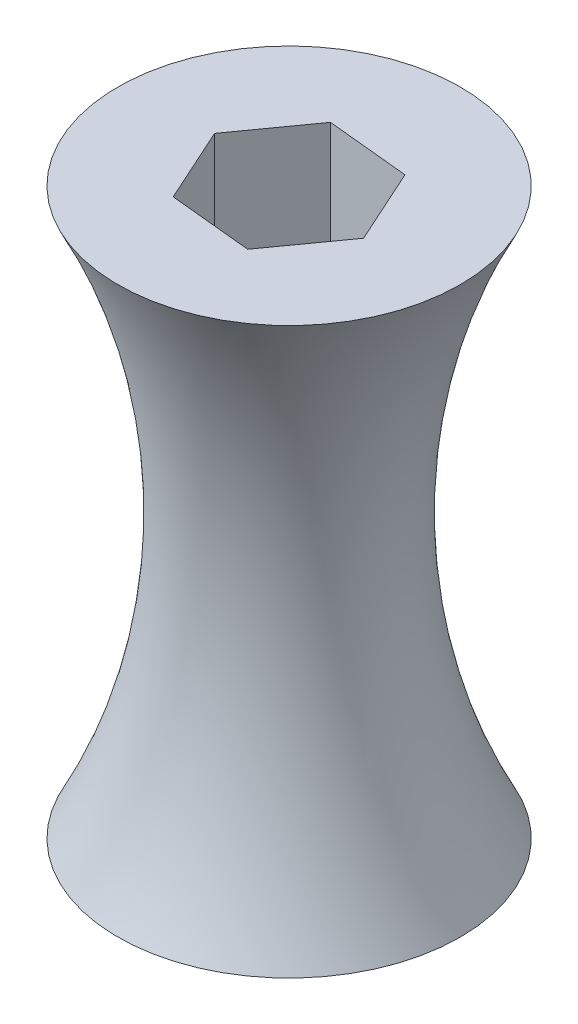
ISO-10303-21;
HEADER;
FILE_DESCRIPTION(('STEP AP214'),'2;1');
FILE_NAME('part.step','',(''),(''),'','','');
FILE_SCHEMA(('AUTOMOTIVE_DESIGN { 1 0 10303 214 1 1 1 1 }'));
ENDSEC;
DATA;
#1=APPLICATION_CONTEXT('core data for automotive mechanical design processes');
#2=APPLICATION_PROTOCOL_DEFINITION('international standard','automotive_design',2000,#1);
#3=PRODUCT_CONTEXT('',#1,'mechanical');
#4=PRODUCT('Part','Part','',(#3));
#5=PRODUCT_RELATED_PRODUCT_CATEGORY('part','',(#4));
#6=PRODUCT_DEFINITION_FORMATION('','',#4);
#7=PRODUCT_DEFINITION_CONTEXT('part definition',#1,'design');
#8=PRODUCT_DEFINITION('design','',#6,#7);
#9=PRODUCT_DEFINITION_SHAPE('','',#8);
#10=(LENGTH_UNIT() NAMED_UNIT(*) SI_UNIT(.MILLI.,.METRE.));
#11=(NAMED_UNIT(*) PLANE_ANGLE_UNIT() SI_UNIT($,.RADIAN.));
#12=(NAMED_UNIT(*) SI_UNIT($,.STERADIAN.) SOLID_ANGLE_UNIT());
#13=UNCERTAINTY_MEASURE_WITH_UNIT(LENGTH_MEASURE(1.E-05),#10,'distance_accuracy_value','');
#14=(GEOMETRIC_REPRESENTATION_CONTEXT(3) GLOBAL_UNCERTAINTY_ASSIGNED_CONTEXT((#13)) GLOBAL_UNIT_ASSIGNED_CONTEXT((#10,
#11,#12)) REPRESENTATION_CONTEXT('',''));
#15=CARTESIAN_POINT('',(0.,0.,0.));
#16=DIRECTION('',(0.,0.,1.));
#17=DIRECTION('',(1.,0.,0.));
#18=AXIS2_PLACEMENT_3D('',#15,#16,#17);
#19=CARTESIAN_POINT('',(0.,104.775,0.));
#20=DIRECTION('',(0.,1.,0.));
#21=DIRECTION('',(0.,0.,1.));
#22=AXIS2_PLACEMENT_3D('',#19,#20,#21);
#23=PLANE('',#22);
#24=DIRECTION('',(0.582558314438273,0.,-0.812788908806486));
#25=VECTOR('',#24,1.);
#26=CARTESIAN_POINT('',(-15.3236366613952,104.775,-1.510781079292));
#27=LINE('',#26,#25);
#28=CARTESIAN_POINT('',(-15.3236366613952,104.775,-1.510781079292));
#29=VERTEX_POINT('',#28);
#30=CARTESIAN_POINT('',(-6.35344353647385,104.775,-14.0260491667768));
#31=VERTEX_POINT('',#30);
#32=EDGE_CURVE('E106',#29,#31,#27,.T.);
#33=ORIENTED_EDGE('',*,*,#32,.T.);
#34=DIRECTION('',(0.995175000159787,0.,0.0981158450861447));
#35=VECTOR('',#34,1.);
#36=CARTESIAN_POINT('',(-6.35344353647385,104.775,-14.0260491667768));
#37=LINE('',#36,#35);
#38=CARTESIAN_POINT('',(8.97019312492135,104.775,-12.5152680874848));
#39=VERTEX_POINT('',#38);
#40=EDGE_CURVE('E92',#31,#39,#37,.T.);
#41=ORIENTED_EDGE('',*,*,#40,.T.);
#42=DIRECTION('',(0.412616685721513,0.,0.910904753892631));
#43=VECTOR('',#42,1.);
#44=CARTESIAN_POINT('',(8.97019312492135,104.775,-12.5152680874848));
#45=LINE('',#44,#43);
#46=CARTESIAN_POINT('',(15.3236366613952,104.775,1.510781079292));
#47=VERTEX_POINT('',#46);
#48=EDGE_CURVE('E135',#39,#47,#45,.T.);
#49=ORIENTED_EDGE('',*,*,#48,.T.);
#50=DIRECTION('',(-0.582558314438273,0.,0.812788908806486));
#51=VECTOR('',#50,1.);
#52=CARTESIAN_POINT('',(15.3236366613952,104.775,1.510781079292));
#53=LINE('',#52,#51);
#54=CARTESIAN_POINT('',(6.35344353647386,104.775,14.0260491667768));
#55=VERTEX_POINT('',#54);
#56=EDGE_CURVE('E130',#47,#55,#53,.T.);
#57=ORIENTED_EDGE('',*,*,#56,.T.);
#58=DIRECTION('',(-0.995175000159787,0.,-0.0981158450861446));
#59=VECTOR('',#58,1.);
#60=CARTESIAN_POINT('',(6.35344353647386,104.775,14.0260491667768));
#61=LINE('',#60,#59);
#62=CARTESIAN_POINT('',(-8.97019312492135,104.775,12.5152680874848));
#63=VERTEX_POINT('',#62);
#64=EDGE_CURVE('E126',#55,#63,#61,.T.);
#65=ORIENTED_EDGE('',*,*,#64,.T.);
#66=DIRECTION('',(-0.412616685721514,0.,-0.91090475389263));
#67=VECTOR('',#66,1.);
#68=CARTESIAN_POINT('',(-8.97019312492135,104.775,12.5152680874848));
#69=LINE('',#68,#67);
#70=EDGE_CURVE('E48',#63,#29,#69,.T.);
#71=ORIENTED_EDGE('',*,*,#70,.T.);
#72=EDGE_LOOP('',(#33,#41,#49,#57,#65,#71));
#73=FACE_BOUND('',#72,.T.);
#74=CARTESIAN_POINT('',(0.,104.775,0.));
#75=DIRECTION('',(0.,-1.,0.));
#76=DIRECTION('',(1.,0.,0.));
#77=AXIS2_PLACEMENT_3D('',#74,#75,#76);
#78=CIRCLE('',#77,31.75);
#79=CARTESIAN_POINT('',(31.75,104.775,0.));
#80=VERTEX_POINT('',#79);
#81=EDGE_CURVE('E164',#80,#80,#78,.T.);
#82=ORIENTED_EDGE('',*,*,#81,.F.);
#83=EDGE_LOOP('',(#82));
#84=FACE_BOUND('',#83,.T.);
#85=ADVANCED_FACE('F39',(#73,#84),#23,.T.);
#86=CARTESIAN_POINT('',(0.,0.,0.));
#87=DIRECTION('',(0.,1.,0.));
#88=DIRECTION('',(0.,0.,1.));
#89=AXIS2_PLACEMENT_3D('',#86,#87,#88);
#90=PLANE('',#89);
#91=DIRECTION('',(0.995175000159787,0.,0.0981158450861447));
#92=VECTOR('',#91,1.);
#93=CARTESIAN_POINT('',(-6.35344353647385,0.,-14.0260491667768));
#94=LINE('',#93,#92);
#95=CARTESIAN_POINT('',(-6.35344353647385,0.,-14.0260491667768));
#96=VERTEX_POINT('',#95);
#97=CARTESIAN_POINT('',(8.97019312492135,0.,-12.5152680874848));
#98=VERTEX_POINT('',#97);
#99=EDGE_CURVE('E152',#96,#98,#94,.T.);
#100=ORIENTED_EDGE('',*,*,#99,.F.);
#101=DIRECTION('',(0.582558314438273,0.,-0.812788908806486));
#102=VECTOR('',#101,1.);
#103=CARTESIAN_POINT('',(-15.3236366613952,0.,-1.510781079292));
#104=LINE('',#103,#102);
#105=CARTESIAN_POINT('',(-15.3236366613952,0.,-1.510781079292));
#106=VERTEX_POINT('',#105);
#107=EDGE_CURVE('E109',#106,#96,#104,.T.);
#108=ORIENTED_EDGE('',*,*,#107,.F.);
#109=DIRECTION('',(-0.412616685721513,0.,-0.91090475389263));
#110=VECTOR('',#109,1.);
#111=CARTESIAN_POINT('',(-8.97019312492135,0.,12.5152680874848));
#112=LINE('',#111,#110);
#113=CARTESIAN_POINT('',(-8.97019312492135,0.,12.5152680874848));
#114=VERTEX_POINT('',#113);
#115=EDGE_CURVE('E121',#114,#106,#112,.T.);
#116=ORIENTED_EDGE('',*,*,#115,.F.);
#117=DIRECTION('',(-0.995175000159787,0.,-0.0981158450861446));
#118=VECTOR('',#117,1.);
#119=CARTESIAN_POINT('',(6.35344353647386,0.,14.0260491667768));
#120=LINE('',#119,#118);
#121=CARTESIAN_POINT('',(6.35344353647386,0.,14.0260491667768));
#122=VERTEX_POINT('',#121);
#123=EDGE_CURVE('E61',#122,#114,#120,.T.);
#124=ORIENTED_EDGE('',*,*,#123,.F.);
#125=DIRECTION('',(-0.582558314438273,0.,0.812788908806486));
#126=VECTOR('',#125,1.);
#127=CARTESIAN_POINT('',(15.3236366613952,0.,1.510781079292));
#128=LINE('',#127,#126);
#129=CARTESIAN_POINT('',(15.3236366613952,0.,1.510781079292));
#130=VERTEX_POINT('',#129);
#131=EDGE_CURVE('E117',#130,#122,#128,.T.);
#132=ORIENTED_EDGE('',*,*,#131,.F.);
#133=DIRECTION('',(0.412616685721513,0.,0.91090475389263));
#134=VECTOR('',#133,1.);
#135=CARTESIAN_POINT('',(8.97019312492135,0.,-12.5152680874848));
#136=LINE('',#135,#134);
#137=EDGE_CURVE('E150',#98,#130,#136,.T.);
#138=ORIENTED_EDGE('',*,*,#137,.F.);
#139=EDGE_LOOP('',(#100,#108,#116,#124,#132,#138));
#140=FACE_BOUND('',#139,.T.);
#141=CARTESIAN_POINT('',(0.,0.,0.));
#142=DIRECTION('',(0.,-1.,0.));
#143=DIRECTION('',(1.,0.,0.));
#144=AXIS2_PLACEMENT_3D('',#141,#142,#143);
#145=CIRCLE('',#144,31.75);
#146=CARTESIAN_POINT('',(31.75,0.,0.));
#147=VERTEX_POINT('',#146);
#148=EDGE_CURVE('E168',#147,#147,#145,.T.);
#149=ORIENTED_EDGE('',*,*,#148,.T.);
#150=EDGE_LOOP('',(#149));
#151=FACE_BOUND('',#150,.T.);
#152=ADVANCED_FACE('F41',(#140,#151),#90,.F.);
#153=CARTESIAN_POINT('',(-15.3236366613952,146.322269260893,-1.510781079292));
#154=DIRECTION('',(-0.812788908806486,0.,-0.582558314438273));
#155=DIRECTION('',(-0.582558314438273,0.,0.812788908806486));
#156=AXIS2_PLACEMENT_3D('',#153,#154,#155);
#157=PLANE('',#156);
#158=DIRECTION('',(0.,-1.,0.));
#159=VECTOR('',#158,1.);
#160=CARTESIAN_POINT('',(-15.3236366613952,146.322269260893,-1.510781079292));
#161=LINE('',#160,#159);
#162=EDGE_CURVE('E11',#29,#106,#161,.T.);
#163=ORIENTED_EDGE('',*,*,#162,.T.);
#164=ORIENTED_EDGE('',*,*,#107,.T.);
#165=DIRECTION('',(0.,-1.,0.));
#166=VECTOR('',#165,1.);
#167=CARTESIAN_POINT('',(-6.35344353647385,146.322269260893,-14.0260491667768));
#168=LINE('',#167,#166);
#169=EDGE_CURVE('E96',#31,#96,#168,.T.);
#170=ORIENTED_EDGE('',*,*,#169,.F.);
#171=ORIENTED_EDGE('',*,*,#32,.F.);
#172=EDGE_LOOP('',(#163,#164,#170,#171));
#173=FACE_BOUND('',#172,.T.);
#174=ADVANCED_FACE('F105',(#173),#157,.F.);
#175=CARTESIAN_POINT('',(-6.35344353647385,146.322269260893,-14.0260491667768));
#176=DIRECTION('',(0.0981158450861447,0.,-0.995175000159787));
#177=DIRECTION('',(-0.995175000159787,0.,-0.0981158450861447));
#178=AXIS2_PLACEMENT_3D('',#175,#176,#177);
#179=PLANE('',#178);
#180=ORIENTED_EDGE('',*,*,#169,.T.);
#181=ORIENTED_EDGE('',*,*,#99,.T.);
#182=DIRECTION('',(0.,-1.,0.));
#183=VECTOR('',#182,1.);
#184=CARTESIAN_POINT('',(8.97019312492135,146.322269260893,-12.5152680874848));
#185=LINE('',#184,#183);
#186=EDGE_CURVE('E98',#39,#98,#185,.T.);
#187=ORIENTED_EDGE('',*,*,#186,.F.);
#188=ORIENTED_EDGE('',*,*,#40,.F.);
#189=EDGE_LOOP('',(#180,#181,#187,#188));
#190=FACE_BOUND('',#189,.T.);
#191=ADVANCED_FACE('F94',(#190),#179,.F.);
#192=CARTESIAN_POINT('',(8.97019312492135,146.322269260893,-12.5152680874848));
#193=DIRECTION('',(0.910904753892631,0.,-0.412616685721513));
#194=DIRECTION('',(-0.412616685721513,0.,-0.910904753892631));
#195=AXIS2_PLACEMENT_3D('',#192,#193,#194);
#196=PLANE('',#195);
#197=ORIENTED_EDGE('',*,*,#186,.T.);
#198=ORIENTED_EDGE('',*,*,#137,.T.);
#199=DIRECTION('',(0.,-1.,0.));
#200=VECTOR('',#199,1.);
#201=CARTESIAN_POINT('',(15.3236366613952,146.322269260893,1.510781079292));
#202=LINE('',#201,#200);
#203=EDGE_CURVE('E134',#47,#130,#202,.T.);
#204=ORIENTED_EDGE('',*,*,#203,.F.);
#205=ORIENTED_EDGE('',*,*,#48,.F.);
#206=EDGE_LOOP('',(#197,#198,#204,#205));
#207=FACE_BOUND('',#206,.T.);
#208=ADVANCED_FACE('F147',(#207),#196,.F.);
#209=CARTESIAN_POINT('',(15.3236366613952,146.322269260893,1.510781079292));
#210=DIRECTION('',(0.812788908806486,0.,0.582558314438273));
#211=DIRECTION('',(0.582558314438273,0.,-0.812788908806486));
#212=AXIS2_PLACEMENT_3D('',#209,#210,#211);
#213=PLANE('',#212);
#214=ORIENTED_EDGE('',*,*,#203,.T.);
#215=ORIENTED_EDGE('',*,*,#131,.T.);
#216=DIRECTION('',(0.,-1.,0.));
#217=VECTOR('',#216,1.);
#218=CARTESIAN_POINT('',(6.35344353647386,146.322269260893,14.0260491667768));
#219=LINE('',#218,#217);
#220=EDGE_CURVE('E129',#55,#122,#219,.T.);
#221=ORIENTED_EDGE('',*,*,#220,.F.);
#222=ORIENTED_EDGE('',*,*,#56,.F.);
#223=EDGE_LOOP('',(#214,#215,#221,#222));
#224=FACE_BOUND('',#223,.T.);
#225=ADVANCED_FACE('F197',(#224),#213,.F.);
#226=CARTESIAN_POINT('',(6.35344353647386,146.322269260893,14.0260491667768));
#227=DIRECTION('',(-0.0981158450861446,0.,0.995175000159787));
#228=DIRECTION('',(0.995175000159787,0.,0.0981158450861446));
#229=AXIS2_PLACEMENT_3D('',#226,#227,#228);
#230=PLANE('',#229);
#231=ORIENTED_EDGE('',*,*,#220,.T.);
#232=ORIENTED_EDGE('',*,*,#123,.T.);
#233=DIRECTION('',(0.,-1.,0.));
#234=VECTOR('',#233,1.);
#235=CARTESIAN_POINT('',(-8.97019312492135,146.322269260893,12.5152680874848));
#236=LINE('',#235,#234);
#237=EDGE_CURVE('E125',#63,#114,#236,.T.);
#238=ORIENTED_EDGE('',*,*,#237,.F.);
#239=ORIENTED_EDGE('',*,*,#64,.F.);
#240=EDGE_LOOP('',(#231,#232,#238,#239));
#241=FACE_BOUND('',#240,.T.);
#242=ADVANCED_FACE('F184',(#241),#230,.F.);
#243=CARTESIAN_POINT('',(-8.97019312492135,146.322269260893,12.5152680874848));
#244=DIRECTION('',(-0.91090475389263,0.,0.412616685721514));
#245=DIRECTION('',(0.412616685721514,0.,0.91090475389263));
#246=AXIS2_PLACEMENT_3D('',#243,#244,#245);
#247=PLANE('',#246);
#248=ORIENTED_EDGE('',*,*,#237,.T.);
#249=ORIENTED_EDGE('',*,*,#115,.T.);
#250=ORIENTED_EDGE('',*,*,#162,.F.);
#251=ORIENTED_EDGE('',*,*,#70,.F.);
#252=EDGE_LOOP('',(#248,#249,#250,#251));
#253=FACE_BOUND('',#252,.T.);
#254=ADVANCED_FACE('F179',(#253),#247,.F.);
#255=CARTESIAN_POINT('',(0.,52.3875,0.));
#256=DIRECTION('',(0.,-1.,0.));
#257=DIRECTION('',(1.,0.,0.));
#258=AXIS2_PLACEMENT_3D('',#255,#256,#257);
#259=TOROIDAL_SURFACE('',#258,133.44921875,114.39921875);
#260=ORIENTED_EDGE('',*,*,#81,.T.);
#261=EDGE_LOOP('',(#260));
#262=FACE_BOUND('',#261,.T.);
#263=ORIENTED_EDGE('',*,*,#148,.F.);
#264=EDGE_LOOP('',(#263));
#265=FACE_BOUND('',#264,.T.);
#266=ADVANCED_FACE('F177',(#262,#265),#259,.F.);
#267=CLOSED_SHELL('',(#85,#152,#174,#191,#208,#225,#242,#254,#266));
#268=MANIFOLD_SOLID_BREP('B2',#267);
#269=ADVANCED_BREP_SHAPE_REPRESENTATION('',(#18,#268),#14);
#270=SHAPE_DEFINITION_REPRESENTATION(#9,#269);
ENDSEC;
END-ISO-10303-21;
